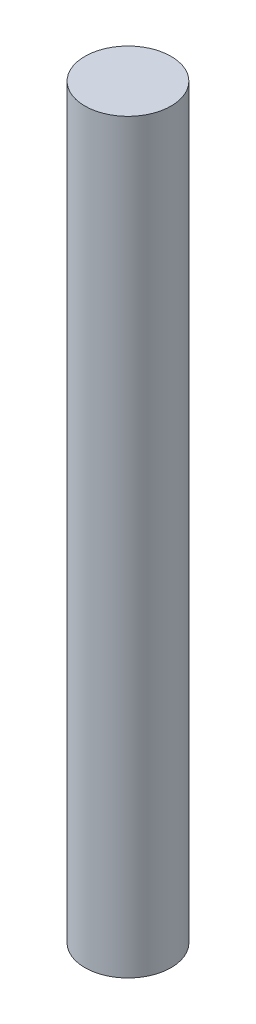
ISO-10303-21;
HEADER;
FILE_DESCRIPTION(('STEP AP214'),'2;1');
FILE_NAME('part.step','',(''),(''),'','','');
FILE_SCHEMA(('AUTOMOTIVE_DESIGN { 1 0 10303 214 1 1 1 1 }'));
ENDSEC;
DATA;
#1=APPLICATION_CONTEXT('core data for automotive mechanical design processes');
#2=APPLICATION_PROTOCOL_DEFINITION('international standard','automotive_design',2000,#1);
#3=PRODUCT_CONTEXT('',#1,'mechanical');
#4=PRODUCT('Part','Part','',(#3));
#5=PRODUCT_RELATED_PRODUCT_CATEGORY('part','',(#4));
#6=PRODUCT_DEFINITION_FORMATION('','',#4);
#7=PRODUCT_DEFINITION_CONTEXT('part definition',#1,'design');
#8=PRODUCT_DEFINITION('design','',#6,#7);
#9=PRODUCT_DEFINITION_SHAPE('','',#8);
#10=(LENGTH_UNIT() NAMED_UNIT(*) SI_UNIT(.MILLI.,.METRE.));
#11=(NAMED_UNIT(*) PLANE_ANGLE_UNIT() SI_UNIT($,.RADIAN.));
#12=(NAMED_UNIT(*) SI_UNIT($,.STERADIAN.) SOLID_ANGLE_UNIT());
#13=UNCERTAINTY_MEASURE_WITH_UNIT(LENGTH_MEASURE(1.E-05),#10,'distance_accuracy_value','');
#14=(GEOMETRIC_REPRESENTATION_CONTEXT(3) GLOBAL_UNCERTAINTY_ASSIGNED_CONTEXT((#13)) GLOBAL_UNIT_ASSIGNED_CONTEXT((#10,
#11,#12)) REPRESENTATION_CONTEXT('',''));
#15=CARTESIAN_POINT('',(0.,0.,0.));
#16=DIRECTION('',(0.,0.,1.));
#17=DIRECTION('',(1.,0.,0.));
#18=AXIS2_PLACEMENT_3D('',#15,#16,#17);
#19=CARTESIAN_POINT('',(0.,27.5,0.));
#20=DIRECTION('',(0.,-1.,0.));
#21=DIRECTION('',(0.,0.,-1.));
#22=AXIS2_PLACEMENT_3D('',#19,#20,#21);
#23=CYLINDRICAL_SURFACE('',#22,1.5875);
#24=CARTESIAN_POINT('',(0.,27.5,0.));
#25=DIRECTION('',(0.,1.,0.));
#26=DIRECTION('',(0.,0.,1.));
#27=AXIS2_PLACEMENT_3D('',#24,#25,#26);
#28=CIRCLE('',#27,1.5875);
#29=CARTESIAN_POINT('',(0.,27.5,1.5875));
#30=VERTEX_POINT('',#29);
#31=EDGE_CURVE('E10',#30,#30,#28,.T.);
#32=ORIENTED_EDGE('',*,*,#31,.F.);
#33=EDGE_LOOP('',(#32));
#34=FACE_BOUND('',#33,.T.);
#35=CARTESIAN_POINT('',(0.,0.,0.));
#36=DIRECTION('',(0.,1.,0.));
#37=DIRECTION('',(0.,0.,1.));
#38=AXIS2_PLACEMENT_3D('',#35,#36,#37);
#39=CIRCLE('',#38,1.5875);
#40=CARTESIAN_POINT('',(0.,0.,1.5875));
#41=VERTEX_POINT('',#40);
#42=EDGE_CURVE('E40',#41,#41,#39,.T.);
#43=ORIENTED_EDGE('',*,*,#42,.T.);
#44=EDGE_LOOP('',(#43));
#45=FACE_BOUND('',#44,.T.);
#46=ADVANCED_FACE('F37',(#34,#45),#23,.T.);
#47=CARTESIAN_POINT('',(0.,27.5,0.));
#48=DIRECTION('',(0.,1.,0.));
#49=DIRECTION('',(0.,0.,1.));
#50=AXIS2_PLACEMENT_3D('',#47,#48,#49);
#51=PLANE('',#50);
#52=ORIENTED_EDGE('',*,*,#31,.T.);
#53=EDGE_LOOP('',(#52));
#54=FACE_BOUND('',#53,.T.);
#55=ADVANCED_FACE('F52',(#54),#51,.T.);
#56=CARTESIAN_POINT('',(0.,0.,0.));
#57=DIRECTION('',(0.,1.,0.));
#58=DIRECTION('',(0.,0.,1.));
#59=AXIS2_PLACEMENT_3D('',#56,#57,#58);
#60=PLANE('',#59);
#61=ORIENTED_EDGE('',*,*,#42,.F.);
#62=EDGE_LOOP('',(#61));
#63=FACE_BOUND('',#62,.T.);
#64=ADVANCED_FACE('F50',(#63),#60,.F.);
#65=CLOSED_SHELL('',(#46,#55,#64));
#66=MANIFOLD_SOLID_BREP('B2',#65);
#67=ADVANCED_BREP_SHAPE_REPRESENTATION('',(#18,#66),#14);
#68=SHAPE_DEFINITION_REPRESENTATION(#9,#67);
ENDSEC;
END-ISO-10303-21;
